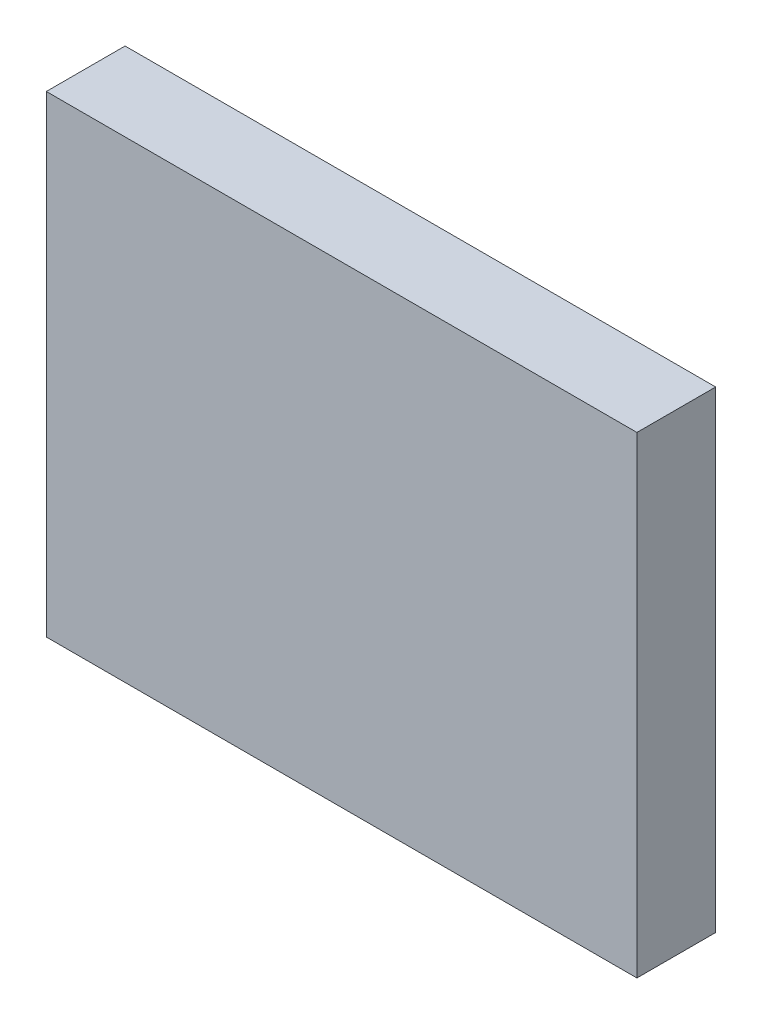
ISO-10303-21;
HEADER;
FILE_DESCRIPTION(('STEP AP214'),'2;1');
FILE_NAME('part.step','',(''),(''),'','','');
FILE_SCHEMA(('AUTOMOTIVE_DESIGN { 1 0 10303 214 1 1 1 1 }'));
ENDSEC;
DATA;
#1=APPLICATION_CONTEXT('core data for automotive mechanical design processes');
#2=APPLICATION_PROTOCOL_DEFINITION('international standard','automotive_design',2000,#1);
#3=PRODUCT_CONTEXT('',#1,'mechanical');
#4=PRODUCT('Part','Part','',(#3));
#5=PRODUCT_RELATED_PRODUCT_CATEGORY('part','',(#4));
#6=PRODUCT_DEFINITION_FORMATION('','',#4);
#7=PRODUCT_DEFINITION_CONTEXT('part definition',#1,'design');
#8=PRODUCT_DEFINITION('design','',#6,#7);
#9=PRODUCT_DEFINITION_SHAPE('','',#8);
#10=(LENGTH_UNIT() NAMED_UNIT(*) SI_UNIT(.MILLI.,.METRE.));
#11=(NAMED_UNIT(*) PLANE_ANGLE_UNIT() SI_UNIT($,.RADIAN.));
#12=(NAMED_UNIT(*) SI_UNIT($,.STERADIAN.) SOLID_ANGLE_UNIT());
#13=UNCERTAINTY_MEASURE_WITH_UNIT(LENGTH_MEASURE(1.E-05),#10,'distance_accuracy_value','');
#14=(GEOMETRIC_REPRESENTATION_CONTEXT(3) GLOBAL_UNCERTAINTY_ASSIGNED_CONTEXT((#13)) GLOBAL_UNIT_ASSIGNED_CONTEXT((#10,
#11,#12)) REPRESENTATION_CONTEXT('',''));
#15=CARTESIAN_POINT('',(0.,0.,0.));
#16=DIRECTION('',(0.,0.,1.));
#17=DIRECTION('',(1.,0.,0.));
#18=AXIS2_PLACEMENT_3D('',#15,#16,#17);
#19=CARTESIAN_POINT('',(0.,0.,0.));
#20=DIRECTION('',(0.,0.,1.));
#21=DIRECTION('',(1.,0.,0.));
#22=AXIS2_PLACEMENT_3D('',#19,#20,#21);
#23=PLANE('',#22);
#24=DIRECTION('',(0.,1.,0.));
#25=VECTOR('',#24,1.);
#26=CARTESIAN_POINT('',(-7.5,6.,0.));
#27=LINE('',#26,#25);
#28=CARTESIAN_POINT('',(-7.5,6.,0.));
#29=VERTEX_POINT('',#28);
#30=CARTESIAN_POINT('',(-7.5,-6.,0.));
#31=VERTEX_POINT('',#30);
#32=EDGE_CURVE('E79',#29,#31,#27,.F.);
#33=ORIENTED_EDGE('',*,*,#32,.F.);
#34=DIRECTION('',(1.,0.,0.));
#35=VECTOR('',#34,1.);
#36=CARTESIAN_POINT('',(7.5,6.,0.));
#37=LINE('',#36,#35);
#38=CARTESIAN_POINT('',(7.5,6.,0.));
#39=VERTEX_POINT('',#38);
#40=EDGE_CURVE('E55',#39,#29,#37,.F.);
#41=ORIENTED_EDGE('',*,*,#40,.F.);
#42=DIRECTION('',(0.,1.,0.));
#43=VECTOR('',#42,1.);
#44=CARTESIAN_POINT('',(7.5,-6.,0.));
#45=LINE('',#44,#43);
#46=CARTESIAN_POINT('',(7.5,-6.,0.));
#47=VERTEX_POINT('',#46);
#48=EDGE_CURVE('E57',#47,#39,#45,.T.);
#49=ORIENTED_EDGE('',*,*,#48,.F.);
#50=DIRECTION('',(1.,0.,0.));
#51=VECTOR('',#50,1.);
#52=CARTESIAN_POINT('',(-7.5,-6.,0.));
#53=LINE('',#52,#51);
#54=EDGE_CURVE('E20',#31,#47,#53,.T.);
#55=ORIENTED_EDGE('',*,*,#54,.F.);
#56=EDGE_LOOP('',(#33,#41,#49,#55));
#57=FACE_BOUND('',#56,.T.);
#58=ADVANCED_FACE('F17',(#57),#23,.F.);
#59=CARTESIAN_POINT('',(-7.5,-6.,0.));
#60=DIRECTION('',(0.,-1.,0.));
#61=DIRECTION('',(0.,0.,-1.));
#62=AXIS2_PLACEMENT_3D('',#59,#60,#61);
#63=PLANE('',#62);
#64=DIRECTION('',(1.,0.,0.));
#65=VECTOR('',#64,1.);
#66=CARTESIAN_POINT('',(0.,-6.,2.));
#67=LINE('',#66,#65);
#68=CARTESIAN_POINT('',(-7.5,-6.,2.));
#69=VERTEX_POINT('',#68);
#70=CARTESIAN_POINT('',(7.5,-6.,2.));
#71=VERTEX_POINT('',#70);
#72=EDGE_CURVE('E83',#69,#71,#67,.T.);
#73=ORIENTED_EDGE('',*,*,#72,.F.);
#74=DIRECTION('',(0.,0.,1.));
#75=VECTOR('',#74,1.);
#76=CARTESIAN_POINT('',(-7.5,-6.,0.));
#77=LINE('',#76,#75);
#78=EDGE_CURVE('E68',#31,#69,#77,.T.);
#79=ORIENTED_EDGE('',*,*,#78,.F.);
#80=ORIENTED_EDGE('',*,*,#54,.T.);
#81=DIRECTION('',(0.,0.,-1.));
#82=VECTOR('',#81,1.);
#83=CARTESIAN_POINT('',(7.5,-6.,0.));
#84=LINE('',#83,#82);
#85=EDGE_CURVE('E63',#71,#47,#84,.T.);
#86=ORIENTED_EDGE('',*,*,#85,.F.);
#87=EDGE_LOOP('',(#73,#79,#80,#86));
#88=FACE_BOUND('',#87,.T.);
#89=ADVANCED_FACE('F65',(#88),#63,.T.);
#90=CARTESIAN_POINT('',(7.5,-6.,0.));
#91=DIRECTION('',(1.,0.,0.));
#92=DIRECTION('',(0.,0.,-1.));
#93=AXIS2_PLACEMENT_3D('',#90,#91,#92);
#94=PLANE('',#93);
#95=DIRECTION('',(0.,1.,0.));
#96=VECTOR('',#95,1.);
#97=CARTESIAN_POINT('',(7.5,0.,2.));
#98=LINE('',#97,#96);
#99=CARTESIAN_POINT('',(7.5,6.,2.));
#100=VERTEX_POINT('',#99);
#101=EDGE_CURVE('E72',#71,#100,#98,.T.);
#102=ORIENTED_EDGE('',*,*,#101,.F.);
#103=ORIENTED_EDGE('',*,*,#85,.T.);
#104=ORIENTED_EDGE('',*,*,#48,.T.);
#105=DIRECTION('',(0.,0.,1.));
#106=VECTOR('',#105,1.);
#107=CARTESIAN_POINT('',(7.5,6.,0.));
#108=LINE('',#107,#106);
#109=EDGE_CURVE('E75',#100,#39,#108,.F.);
#110=ORIENTED_EDGE('',*,*,#109,.F.);
#111=EDGE_LOOP('',(#102,#103,#104,#110));
#112=FACE_BOUND('',#111,.T.);
#113=ADVANCED_FACE('F70',(#112),#94,.T.);
#114=CARTESIAN_POINT('',(7.5,6.,0.));
#115=DIRECTION('',(0.,1.,0.));
#116=DIRECTION('',(0.,0.,1.));
#117=AXIS2_PLACEMENT_3D('',#114,#115,#116);
#118=PLANE('',#117);
#119=DIRECTION('',(1.,0.,0.));
#120=VECTOR('',#119,1.);
#121=CARTESIAN_POINT('',(0.,6.,2.));
#122=LINE('',#121,#120);
#123=CARTESIAN_POINT('',(-7.5,6.,2.));
#124=VERTEX_POINT('',#123);
#125=EDGE_CURVE('E26',#100,#124,#122,.F.);
#126=ORIENTED_EDGE('',*,*,#125,.F.);
#127=ORIENTED_EDGE('',*,*,#109,.T.);
#128=ORIENTED_EDGE('',*,*,#40,.T.);
#129=DIRECTION('',(0.,0.,1.));
#130=VECTOR('',#129,1.);
#131=CARTESIAN_POINT('',(-7.5,6.,0.));
#132=LINE('',#131,#130);
#133=EDGE_CURVE('E35',#124,#29,#132,.F.);
#134=ORIENTED_EDGE('',*,*,#133,.F.);
#135=EDGE_LOOP('',(#126,#127,#128,#134));
#136=FACE_BOUND('',#135,.T.);
#137=ADVANCED_FACE('F89',(#136),#118,.T.);
#138=CARTESIAN_POINT('',(-7.5,6.,0.));
#139=DIRECTION('',(-1.,0.,0.));
#140=DIRECTION('',(0.,0.,1.));
#141=AXIS2_PLACEMENT_3D('',#138,#139,#140);
#142=PLANE('',#141);
#143=DIRECTION('',(0.,1.,0.));
#144=VECTOR('',#143,1.);
#145=CARTESIAN_POINT('',(-7.5,0.,2.));
#146=LINE('',#145,#144);
#147=EDGE_CURVE('E11',#124,#69,#146,.F.);
#148=ORIENTED_EDGE('',*,*,#147,.F.);
#149=ORIENTED_EDGE('',*,*,#133,.T.);
#150=ORIENTED_EDGE('',*,*,#32,.T.);
#151=ORIENTED_EDGE('',*,*,#78,.T.);
#152=EDGE_LOOP('',(#148,#149,#150,#151));
#153=FACE_BOUND('',#152,.T.);
#154=ADVANCED_FACE('F91',(#153),#142,.T.);
#155=CARTESIAN_POINT('',(0.,0.,2.));
#156=DIRECTION('',(0.,0.,1.));
#157=DIRECTION('',(1.,0.,0.));
#158=AXIS2_PLACEMENT_3D('',#155,#156,#157);
#159=PLANE('',#158);
#160=ORIENTED_EDGE('',*,*,#125,.T.);
#161=ORIENTED_EDGE('',*,*,#147,.T.);
#162=ORIENTED_EDGE('',*,*,#72,.T.);
#163=ORIENTED_EDGE('',*,*,#101,.T.);
#164=EDGE_LOOP('',(#160,#161,#162,#163));
#165=FACE_BOUND('',#164,.T.);
#166=ADVANCED_FACE('F88',(#165),#159,.T.);
#167=CLOSED_SHELL('',(#58,#89,#113,#137,#154,#166));
#168=MANIFOLD_SOLID_BREP('B1',#167);
#169=ADVANCED_BREP_SHAPE_REPRESENTATION('',(#18,#168),#14);
#170=SHAPE_DEFINITION_REPRESENTATION(#9,#169);
ENDSEC;
END-ISO-10303-21;
